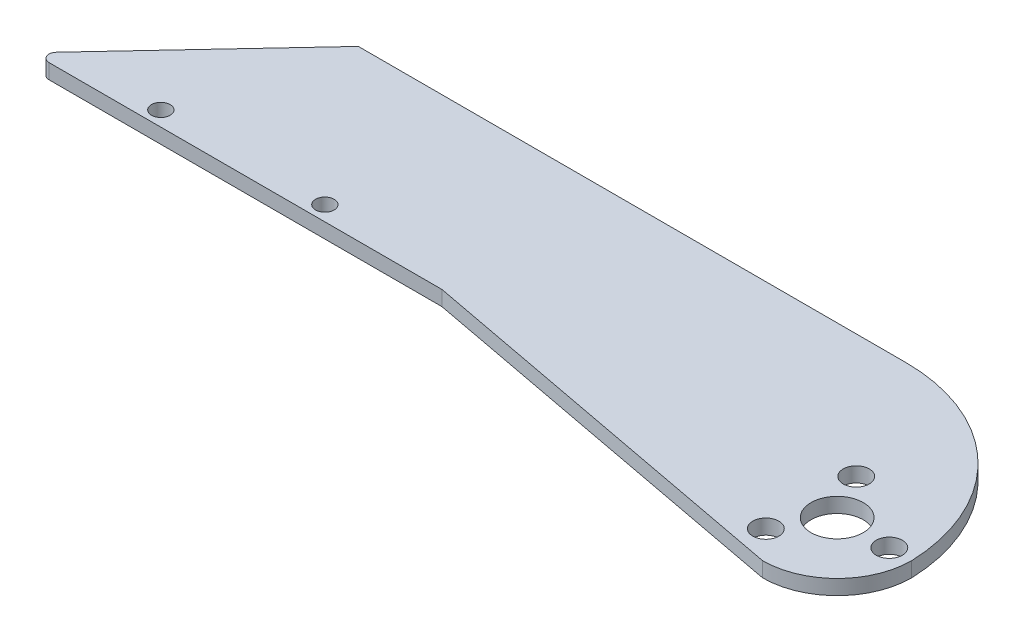
ISO-10303-21;
HEADER;
FILE_DESCRIPTION(('STEP AP214'),'2;1');
FILE_NAME('part.step','',(''),(''),'','','');
FILE_SCHEMA(('AUTOMOTIVE_DESIGN { 1 0 10303 214 1 1 1 1 }'));
ENDSEC;
DATA;
#1=APPLICATION_CONTEXT('core data for automotive mechanical design processes');
#2=APPLICATION_PROTOCOL_DEFINITION('international standard','automotive_design',2000,#1);
#3=PRODUCT_CONTEXT('',#1,'mechanical');
#4=PRODUCT('Part','Part','',(#3));
#5=PRODUCT_RELATED_PRODUCT_CATEGORY('part','',(#4));
#6=PRODUCT_DEFINITION_FORMATION('','',#4);
#7=PRODUCT_DEFINITION_CONTEXT('part definition',#1,'design');
#8=PRODUCT_DEFINITION('design','',#6,#7);
#9=PRODUCT_DEFINITION_SHAPE('','',#8);
#10=(LENGTH_UNIT() NAMED_UNIT(*) SI_UNIT(.MILLI.,.METRE.));
#11=(NAMED_UNIT(*) PLANE_ANGLE_UNIT() SI_UNIT($,.RADIAN.));
#12=(NAMED_UNIT(*) SI_UNIT($,.STERADIAN.) SOLID_ANGLE_UNIT());
#13=UNCERTAINTY_MEASURE_WITH_UNIT(LENGTH_MEASURE(1.E-05),#10,'distance_accuracy_value','');
#14=(GEOMETRIC_REPRESENTATION_CONTEXT(3) GLOBAL_UNCERTAINTY_ASSIGNED_CONTEXT((#13)) GLOBAL_UNIT_ASSIGNED_CONTEXT((#10,
#11,#12)) REPRESENTATION_CONTEXT('',''));
#15=CARTESIAN_POINT('',(0.,0.,0.));
#16=DIRECTION('',(0.,0.,1.));
#17=DIRECTION('',(1.,0.,0.));
#18=AXIS2_PLACEMENT_3D('',#15,#16,#17);
#19=CARTESIAN_POINT('',(-13.4267183875394,2.,0.818104259805705));
#20=DIRECTION('',(0.,-1.,0.));
#21=DIRECTION('',(0.,0.,-1.));
#22=AXIS2_PLACEMENT_3D('',#19,#20,#21);
#23=CYLINDRICAL_SURFACE('',#22,23.4409988905975);
#24=CARTESIAN_POINT('',(-13.4267183875394,0.,0.818104259805705));
#25=DIRECTION('',(0.,1.,0.));
#26=DIRECTION('',(0.,0.,1.));
#27=AXIS2_PLACEMENT_3D('',#24,#25,#26);
#28=CIRCLE('',#27,23.4409988905975);
#29=CARTESIAN_POINT('',(-13.4267183875394,0.,-22.6228946307918));
#30=VERTEX_POINT('',#29);
#31=CARTESIAN_POINT('',(10.,0.,-3.42607886505419E-13));
#32=VERTEX_POINT('',#31);
#33=EDGE_CURVE('E98',#30,#32,#28,.F.);
#34=ORIENTED_EDGE('',*,*,#33,.F.);
#35=DIRECTION('',(0.,-1.,0.));
#36=VECTOR('',#35,1.);
#37=CARTESIAN_POINT('',(-13.4267183875394,2.,-22.6228946307918));
#38=LINE('',#37,#36);
#39=CARTESIAN_POINT('',(-13.4267183875394,2.,-22.6228946307918));
#40=VERTEX_POINT('',#39);
#41=EDGE_CURVE('E94',#40,#30,#38,.T.);
#42=ORIENTED_EDGE('',*,*,#41,.F.);
#43=CARTESIAN_POINT('',(-13.4267183875394,2.,0.818104259805705));
#44=DIRECTION('',(0.,1.,0.));
#45=DIRECTION('',(0.,0.,1.));
#46=AXIS2_PLACEMENT_3D('',#43,#44,#45);
#47=CIRCLE('',#46,23.4409988905975);
#48=CARTESIAN_POINT('',(10.,2.,-3.42607886505419E-13));
#49=VERTEX_POINT('',#48);
#50=EDGE_CURVE('E96',#40,#49,#47,.F.);
#51=ORIENTED_EDGE('',*,*,#50,.T.);
#52=DIRECTION('',(0.,-1.,0.));
#53=VECTOR('',#52,1.);
#54=CARTESIAN_POINT('',(10.,2.,-3.42607886505419E-13));
#55=LINE('',#54,#53);
#56=EDGE_CURVE('E146',#49,#32,#55,.T.);
#57=ORIENTED_EDGE('',*,*,#56,.T.);
#58=EDGE_LOOP('',(#34,#42,#51,#57));
#59=FACE_BOUND('',#58,.T.);
#60=ADVANCED_FACE('F37',(#59),#23,.T.);
#61=CARTESIAN_POINT('',(0.,2.,-22.6228946307918));
#62=DIRECTION('',(0.,0.,-1.));
#63=DIRECTION('',(-1.,0.,0.));
#64=AXIS2_PLACEMENT_3D('',#61,#62,#63);
#65=PLANE('',#64);
#66=DIRECTION('',(1.,0.,0.));
#67=VECTOR('',#66,1.);
#68=CARTESIAN_POINT('',(0.,0.,-22.6228946307918));
#69=LINE('',#68,#67);
#70=CARTESIAN_POINT('',(-86.8373877704956,0.,-22.6228946307918));
#71=VERTEX_POINT('',#70);
#72=EDGE_CURVE('E151',#71,#30,#69,.T.);
#73=ORIENTED_EDGE('',*,*,#72,.F.);
#74=DIRECTION('',(0.,-1.,0.));
#75=VECTOR('',#74,1.);
#76=CARTESIAN_POINT('',(-86.8373877704956,2.,-22.6228946307918));
#77=LINE('',#76,#75);
#78=CARTESIAN_POINT('',(-86.8373877704956,2.,-22.6228946307918));
#79=VERTEX_POINT('',#78);
#80=EDGE_CURVE('E104',#79,#71,#77,.T.);
#81=ORIENTED_EDGE('',*,*,#80,.F.);
#82=DIRECTION('',(1.,0.,0.));
#83=VECTOR('',#82,1.);
#84=CARTESIAN_POINT('',(0.,2.,-22.6228946307918));
#85=LINE('',#84,#83);
#86=EDGE_CURVE('E110',#79,#40,#85,.T.);
#87=ORIENTED_EDGE('',*,*,#86,.T.);
#88=ORIENTED_EDGE('',*,*,#41,.T.);
#89=EDGE_LOOP('',(#73,#81,#87,#88));
#90=FACE_BOUND('',#89,.T.);
#91=ADVANCED_FACE('F118',(#90),#65,.T.);
#92=CARTESIAN_POINT('',(-57.5978863276352,2.,-53.8800075535761));
#93=DIRECTION('',(-0.730283343841908,0.,-0.683144375448617));
#94=DIRECTION('',(-0.683144375448617,0.,0.730283343841908));
#95=AXIS2_PLACEMENT_3D('',#92,#93,#94);
#96=PLANE('',#95);
#97=DIRECTION('',(0.683144375448617,0.,-0.730283343841908));
#98=VECTOR('',#97,1.);
#99=CARTESIAN_POINT('',(-57.5978863276352,0.,-53.8800075535761));
#100=LINE('',#99,#98);
#101=CARTESIAN_POINT('',(-106.425500700719,0.,-1.6831443754486));
#102=VERTEX_POINT('',#101);
#103=EDGE_CURVE('E153',#102,#71,#100,.T.);
#104=ORIENTED_EDGE('',*,*,#103,.F.);
#105=DIRECTION('',(0.,-1.,0.));
#106=VECTOR('',#105,1.);
#107=CARTESIAN_POINT('',(-106.425500700719,2.,-1.68314437544861));
#108=LINE('',#107,#106);
#109=CARTESIAN_POINT('',(-106.425500700719,2.,-1.6831443754486));
#110=VERTEX_POINT('',#109);
#111=EDGE_CURVE('E45',#102,#110,#108,.F.);
#112=ORIENTED_EDGE('',*,*,#111,.T.);
#113=DIRECTION('',(0.683144375448617,0.,-0.730283343841908));
#114=VECTOR('',#113,1.);
#115=CARTESIAN_POINT('',(-57.5978863276352,2.,-53.8800075535761));
#116=LINE('',#115,#114);
#117=EDGE_CURVE('E120',#110,#79,#116,.T.);
#118=ORIENTED_EDGE('',*,*,#117,.T.);
#119=ORIENTED_EDGE('',*,*,#80,.T.);
#120=EDGE_LOOP('',(#104,#112,#118,#119));
#121=FACE_BOUND('',#120,.T.);
#122=ADVANCED_FACE('F211',(#121),#96,.T.);
#123=CARTESIAN_POINT('',(0.,2.,0.));
#124=DIRECTION('',(0.,0.,-1.));
#125=DIRECTION('',(-1.,0.,0.));
#126=AXIS2_PLACEMENT_3D('',#123,#124,#125);
#127=PLANE('',#126);
#128=DIRECTION('',(1.,0.,0.));
#129=VECTOR('',#128,1.);
#130=CARTESIAN_POINT('',(0.,2.,0.));
#131=LINE('',#130,#129);
#132=CARTESIAN_POINT('',(-105.695217356877,2.,0.));
#133=VERTEX_POINT('',#132);
#134=CARTESIAN_POINT('',(-53.,2.,0.));
#135=VERTEX_POINT('',#134);
#136=EDGE_CURVE('E122',#133,#135,#131,.T.);
#137=ORIENTED_EDGE('',*,*,#136,.F.);
#138=DIRECTION('',(0.,-1.,0.));
#139=VECTOR('',#138,1.);
#140=CARTESIAN_POINT('',(-105.695217356877,0.,0.));
#141=LINE('',#140,#139);
#142=CARTESIAN_POINT('',(-105.695217356877,0.,0.));
#143=VERTEX_POINT('',#142);
#144=EDGE_CURVE('E103',#133,#143,#141,.T.);
#145=ORIENTED_EDGE('',*,*,#144,.T.);
#146=DIRECTION('',(1.,0.,0.));
#147=VECTOR('',#146,1.);
#148=CARTESIAN_POINT('',(0.,0.,0.));
#149=LINE('',#148,#147);
#150=CARTESIAN_POINT('',(-53.,0.,0.));
#151=VERTEX_POINT('',#150);
#152=EDGE_CURVE('E155',#143,#151,#149,.T.);
#153=ORIENTED_EDGE('',*,*,#152,.T.);
#154=DIRECTION('',(0.,-1.,0.));
#155=VECTOR('',#154,1.);
#156=CARTESIAN_POINT('',(-53.,2.,0.));
#157=LINE('',#156,#155);
#158=EDGE_CURVE('E181',#135,#151,#157,.T.);
#159=ORIENTED_EDGE('',*,*,#158,.F.);
#160=EDGE_LOOP('',(#137,#145,#153,#159));
#161=FACE_BOUND('',#160,.T.);
#162=ADVANCED_FACE('F190',(#161),#127,.F.);
#163=CARTESIAN_POINT('',(-1.82193193537298,2.,9.6562392574768));
#164=DIRECTION('',(-0.185407859197825,0.,0.982661653748471));
#165=DIRECTION('',(0.982661653748471,0.,0.185407859197825));
#166=AXIS2_PLACEMENT_3D('',#163,#164,#165);
#167=PLANE('',#166);
#168=DIRECTION('',(-0.982661653748471,0.,-0.185407859197825));
#169=VECTOR('',#168,1.);
#170=CARTESIAN_POINT('',(-1.82193193537298,0.,9.6562392574768));
#171=LINE('',#170,#169);
#172=CARTESIAN_POINT('',(0.,0.,10.));
#173=VERTEX_POINT('',#172);
#174=EDGE_CURVE('E157',#173,#151,#171,.T.);
#175=ORIENTED_EDGE('',*,*,#174,.F.);
#176=DIRECTION('',(0.,-1.,0.));
#177=VECTOR('',#176,1.);
#178=CARTESIAN_POINT('',(0.,2.,10.));
#179=LINE('',#178,#177);
#180=CARTESIAN_POINT('',(0.,2.,10.));
#181=VERTEX_POINT('',#180);
#182=EDGE_CURVE('E179',#181,#173,#179,.T.);
#183=ORIENTED_EDGE('',*,*,#182,.F.);
#184=DIRECTION('',(-0.982661653748471,0.,-0.185407859197825));
#185=VECTOR('',#184,1.);
#186=CARTESIAN_POINT('',(-1.82193193537298,2.,9.6562392574768));
#187=LINE('',#186,#185);
#188=EDGE_CURVE('E127',#181,#135,#187,.T.);
#189=ORIENTED_EDGE('',*,*,#188,.T.);
#190=ORIENTED_EDGE('',*,*,#158,.T.);
#191=EDGE_LOOP('',(#175,#183,#189,#190));
#192=FACE_BOUND('',#191,.T.);
#193=ADVANCED_FACE('F199',(#192),#167,.T.);
#194=CARTESIAN_POINT('',(7.,2.,0.));
#195=DIRECTION('',(0.,-1.,0.));
#196=DIRECTION('',(0.,0.,-1.));
#197=AXIS2_PLACEMENT_3D('',#194,#195,#196);
#198=CYLINDRICAL_SURFACE('',#197,1.75);
#199=CARTESIAN_POINT('',(7.,2.,0.));
#200=DIRECTION('',(0.,1.,0.));
#201=DIRECTION('',(0.,0.,1.));
#202=AXIS2_PLACEMENT_3D('',#199,#200,#201);
#203=CIRCLE('',#202,1.75);
#204=CARTESIAN_POINT('',(7.,2.,1.75));
#205=VERTEX_POINT('',#204);
#206=EDGE_CURVE('E140',#205,#205,#203,.T.);
#207=ORIENTED_EDGE('',*,*,#206,.T.);
#208=EDGE_LOOP('',(#207));
#209=FACE_BOUND('',#208,.T.);
#210=CARTESIAN_POINT('',(7.,0.,0.));
#211=DIRECTION('',(0.,1.,0.));
#212=DIRECTION('',(0.,0.,1.));
#213=AXIS2_PLACEMENT_3D('',#210,#211,#212);
#214=CIRCLE('',#213,1.75);
#215=CARTESIAN_POINT('',(7.,0.,1.75));
#216=VERTEX_POINT('',#215);
#217=EDGE_CURVE('E172',#216,#216,#214,.T.);
#218=ORIENTED_EDGE('',*,*,#217,.F.);
#219=EDGE_LOOP('',(#218));
#220=FACE_BOUND('',#219,.T.);
#221=ADVANCED_FACE('F238',(#209,#220),#198,.F.);
#222=CARTESIAN_POINT('',(-92.7051831779957,2.,-2.));
#223=DIRECTION('',(0.,-1.,0.));
#224=DIRECTION('',(0.,0.,-1.));
#225=AXIS2_PLACEMENT_3D('',#222,#223,#224);
#226=CYLINDRICAL_SURFACE('',#225,1.25);
#227=CARTESIAN_POINT('',(-92.7051831779957,2.,-2.));
#228=DIRECTION('',(0.,1.,0.));
#229=DIRECTION('',(0.,0.,1.));
#230=AXIS2_PLACEMENT_3D('',#227,#228,#229);
#231=CIRCLE('',#230,1.25);
#232=CARTESIAN_POINT('',(-92.7051831779957,2.,-0.750000000000002));
#233=VERTEX_POINT('',#232);
#234=EDGE_CURVE('E137',#233,#233,#231,.T.);
#235=ORIENTED_EDGE('',*,*,#234,.T.);
#236=EDGE_LOOP('',(#235));
#237=FACE_BOUND('',#236,.T.);
#238=CARTESIAN_POINT('',(-92.7051831779957,0.,-2.));
#239=DIRECTION('',(0.,1.,0.));
#240=DIRECTION('',(0.,0.,1.));
#241=AXIS2_PLACEMENT_3D('',#238,#239,#240);
#242=CIRCLE('',#241,1.25);
#243=CARTESIAN_POINT('',(-92.7051831779957,0.,-0.750000000000002));
#244=VERTEX_POINT('',#243);
#245=EDGE_CURVE('E169',#244,#244,#242,.T.);
#246=ORIENTED_EDGE('',*,*,#245,.F.);
#247=EDGE_LOOP('',(#246));
#248=FACE_BOUND('',#247,.T.);
#249=ADVANCED_FACE('F241',(#237,#248),#226,.F.);
#250=CARTESIAN_POINT('',(-70.7051831779957,2.,-2.));
#251=DIRECTION('',(0.,-1.,0.));
#252=DIRECTION('',(0.,0.,-1.));
#253=AXIS2_PLACEMENT_3D('',#250,#251,#252);
#254=CYLINDRICAL_SURFACE('',#253,1.25);
#255=CARTESIAN_POINT('',(-70.7051831779957,2.,-2.));
#256=DIRECTION('',(0.,1.,0.));
#257=DIRECTION('',(0.,0.,1.));
#258=AXIS2_PLACEMENT_3D('',#255,#256,#257);
#259=CIRCLE('',#258,1.25);
#260=CARTESIAN_POINT('',(-70.7051831779957,2.,-0.750000000000002));
#261=VERTEX_POINT('',#260);
#262=EDGE_CURVE('E134',#261,#261,#259,.T.);
#263=ORIENTED_EDGE('',*,*,#262,.T.);
#264=EDGE_LOOP('',(#263));
#265=FACE_BOUND('',#264,.T.);
#266=CARTESIAN_POINT('',(-70.7051831779957,0.,-2.));
#267=DIRECTION('',(0.,1.,0.));
#268=DIRECTION('',(0.,0.,1.));
#269=AXIS2_PLACEMENT_3D('',#266,#267,#268);
#270=CIRCLE('',#269,1.25);
#271=CARTESIAN_POINT('',(-70.7051831779957,0.,-0.750000000000002));
#272=VERTEX_POINT('',#271);
#273=EDGE_CURVE('E166',#272,#272,#270,.T.);
#274=ORIENTED_EDGE('',*,*,#273,.F.);
#275=EDGE_LOOP('',(#274));
#276=FACE_BOUND('',#275,.T.);
#277=ADVANCED_FACE('F245',(#265,#276),#254,.F.);
#278=CARTESIAN_POINT('',(-3.5,2.,-6.06217782649107));
#279=DIRECTION('',(0.,-1.,0.));
#280=DIRECTION('',(0.,0.,-1.));
#281=AXIS2_PLACEMENT_3D('',#278,#279,#280);
#282=CYLINDRICAL_SURFACE('',#281,1.75);
#283=CARTESIAN_POINT('',(-3.5,2.,-6.06217782649107));
#284=DIRECTION('',(0.,1.,0.));
#285=DIRECTION('',(0.,0.,1.));
#286=AXIS2_PLACEMENT_3D('',#283,#284,#285);
#287=CIRCLE('',#286,1.75);
#288=CARTESIAN_POINT('',(-3.5,2.,-4.31217782649107));
#289=VERTEX_POINT('',#288);
#290=EDGE_CURVE('E131',#289,#289,#287,.T.);
#291=ORIENTED_EDGE('',*,*,#290,.T.);
#292=EDGE_LOOP('',(#291));
#293=FACE_BOUND('',#292,.T.);
#294=CARTESIAN_POINT('',(-3.5,0.,-6.06217782649107));
#295=DIRECTION('',(0.,1.,0.));
#296=DIRECTION('',(0.,0.,1.));
#297=AXIS2_PLACEMENT_3D('',#294,#295,#296);
#298=CIRCLE('',#297,1.75);
#299=CARTESIAN_POINT('',(-3.5,0.,-4.31217782649107));
#300=VERTEX_POINT('',#299);
#301=EDGE_CURVE('E163',#300,#300,#298,.T.);
#302=ORIENTED_EDGE('',*,*,#301,.F.);
#303=EDGE_LOOP('',(#302));
#304=FACE_BOUND('',#303,.T.);
#305=ADVANCED_FACE('F225',(#293,#304),#282,.F.);
#306=CARTESIAN_POINT('',(0.,2.,0.));
#307=DIRECTION('',(0.,-1.,0.));
#308=DIRECTION('',(0.,0.,-1.));
#309=AXIS2_PLACEMENT_3D('',#306,#307,#308);
#310=CYLINDRICAL_SURFACE('',#309,10.);
#311=CARTESIAN_POINT('',(0.,0.,0.));
#312=DIRECTION('',(0.,1.,0.));
#313=DIRECTION('',(0.,0.,1.));
#314=AXIS2_PLACEMENT_3D('',#311,#312,#313);
#315=CIRCLE('',#314,10.);
#316=EDGE_CURVE('E160',#173,#32,#315,.T.);
#317=ORIENTED_EDGE('',*,*,#316,.T.);
#318=ORIENTED_EDGE('',*,*,#56,.F.);
#319=CARTESIAN_POINT('',(0.,2.,0.));
#320=DIRECTION('',(0.,1.,0.));
#321=DIRECTION('',(0.,0.,1.));
#322=AXIS2_PLACEMENT_3D('',#319,#320,#321);
#323=CIRCLE('',#322,10.);
#324=EDGE_CURVE('E113',#181,#49,#323,.T.);
#325=ORIENTED_EDGE('',*,*,#324,.F.);
#326=ORIENTED_EDGE('',*,*,#182,.T.);
#327=EDGE_LOOP('',(#317,#318,#325,#326));
#328=FACE_BOUND('',#327,.T.);
#329=ADVANCED_FACE('F217',(#328),#310,.T.);
#330=CARTESIAN_POINT('',(0.,2.,0.));
#331=DIRECTION('',(0.,-1.,0.));
#332=DIRECTION('',(0.,0.,-1.));
#333=AXIS2_PLACEMENT_3D('',#330,#331,#332);
#334=CYLINDRICAL_SURFACE('',#333,3.5);
#335=CARTESIAN_POINT('',(0.,2.,0.));
#336=DIRECTION('',(0.,1.,0.));
#337=DIRECTION('',(0.,0.,1.));
#338=AXIS2_PLACEMENT_3D('',#335,#336,#337);
#339=CIRCLE('',#338,3.5);
#340=CARTESIAN_POINT('',(0.,2.,3.5));
#341=VERTEX_POINT('',#340);
#342=EDGE_CURVE('E115',#341,#341,#339,.T.);
#343=ORIENTED_EDGE('',*,*,#342,.T.);
#344=EDGE_LOOP('',(#343));
#345=FACE_BOUND('',#344,.T.);
#346=CARTESIAN_POINT('',(0.,0.,0.));
#347=DIRECTION('',(0.,1.,0.));
#348=DIRECTION('',(0.,0.,1.));
#349=AXIS2_PLACEMENT_3D('',#346,#347,#348);
#350=CIRCLE('',#349,3.5);
#351=CARTESIAN_POINT('',(0.,0.,3.5));
#352=VERTEX_POINT('',#351);
#353=EDGE_CURVE('E147',#352,#352,#350,.T.);
#354=ORIENTED_EDGE('',*,*,#353,.F.);
#355=EDGE_LOOP('',(#354));
#356=FACE_BOUND('',#355,.T.);
#357=ADVANCED_FACE('F214',(#345,#356),#334,.F.);
#358=CARTESIAN_POINT('',(-3.5,2.,6.06217782649107));
#359=DIRECTION('',(0.,-1.,0.));
#360=DIRECTION('',(0.,0.,-1.));
#361=AXIS2_PLACEMENT_3D('',#358,#359,#360);
#362=CYLINDRICAL_SURFACE('',#361,1.75);
#363=CARTESIAN_POINT('',(-3.5,2.,6.06217782649107));
#364=DIRECTION('',(0.,1.,0.));
#365=DIRECTION('',(0.,0.,1.));
#366=AXIS2_PLACEMENT_3D('',#363,#364,#365);
#367=CIRCLE('',#366,1.75);
#368=CARTESIAN_POINT('',(-3.5,2.,7.81217782649107));
#369=VERTEX_POINT('',#368);
#370=EDGE_CURVE('E143',#369,#369,#367,.T.);
#371=ORIENTED_EDGE('',*,*,#370,.T.);
#372=EDGE_LOOP('',(#371));
#373=FACE_BOUND('',#372,.T.);
#374=CARTESIAN_POINT('',(-3.5,0.,6.06217782649107));
#375=DIRECTION('',(0.,1.,0.));
#376=DIRECTION('',(0.,0.,1.));
#377=AXIS2_PLACEMENT_3D('',#374,#375,#376);
#378=CIRCLE('',#377,1.75);
#379=CARTESIAN_POINT('',(-3.5,0.,7.81217782649107));
#380=VERTEX_POINT('',#379);
#381=EDGE_CURVE('E175',#380,#380,#378,.T.);
#382=ORIENTED_EDGE('',*,*,#381,.F.);
#383=EDGE_LOOP('',(#382));
#384=FACE_BOUND('',#383,.T.);
#385=ADVANCED_FACE('F216',(#373,#384),#362,.F.);
#386=CARTESIAN_POINT('',(0.,2.,0.));
#387=DIRECTION('',(0.,1.,0.));
#388=DIRECTION('',(0.,0.,1.));
#389=AXIS2_PLACEMENT_3D('',#386,#387,#388);
#390=PLANE('',#389);
#391=ORIENTED_EDGE('',*,*,#342,.F.);
#392=EDGE_LOOP('',(#391));
#393=FACE_BOUND('',#392,.T.);
#394=ORIENTED_EDGE('',*,*,#117,.F.);
#395=CARTESIAN_POINT('',(-105.695217356877,2.,-0.99999999999998));
#396=DIRECTION('',(0.,1.,0.));
#397=DIRECTION('',(0.,0.,1.));
#398=AXIS2_PLACEMENT_3D('',#395,#396,#397);
#399=CIRCLE('',#398,1.);
#400=EDGE_CURVE('E11',#110,#133,#399,.T.);
#401=ORIENTED_EDGE('',*,*,#400,.T.);
#402=ORIENTED_EDGE('',*,*,#136,.T.);
#403=ORIENTED_EDGE('',*,*,#188,.F.);
#404=ORIENTED_EDGE('',*,*,#324,.T.);
#405=ORIENTED_EDGE('',*,*,#50,.F.);
#406=ORIENTED_EDGE('',*,*,#86,.F.);
#407=EDGE_LOOP('',(#394,#401,#402,#403,#404,#405,#406));
#408=FACE_BOUND('',#407,.T.);
#409=ORIENTED_EDGE('',*,*,#290,.F.);
#410=EDGE_LOOP('',(#409));
#411=FACE_BOUND('',#410,.T.);
#412=ORIENTED_EDGE('',*,*,#262,.F.);
#413=EDGE_LOOP('',(#412));
#414=FACE_BOUND('',#413,.T.);
#415=ORIENTED_EDGE('',*,*,#234,.F.);
#416=EDGE_LOOP('',(#415));
#417=FACE_BOUND('',#416,.T.);
#418=ORIENTED_EDGE('',*,*,#206,.F.);
#419=EDGE_LOOP('',(#418));
#420=FACE_BOUND('',#419,.T.);
#421=ORIENTED_EDGE('',*,*,#370,.F.);
#422=EDGE_LOOP('',(#421));
#423=FACE_BOUND('',#422,.T.);
#424=ADVANCED_FACE('F108',(#393,#408,#411,#414,#417,#420,#423),#390,.T.);
#425=CARTESIAN_POINT('',(0.,0.,0.));
#426=DIRECTION('',(0.,1.,0.));
#427=DIRECTION('',(0.,0.,1.));
#428=AXIS2_PLACEMENT_3D('',#425,#426,#427);
#429=PLANE('',#428);
#430=ORIENTED_EDGE('',*,*,#353,.T.);
#431=EDGE_LOOP('',(#430));
#432=FACE_BOUND('',#431,.T.);
#433=ORIENTED_EDGE('',*,*,#152,.F.);
#434=CARTESIAN_POINT('',(-105.695217356877,0.,-0.99999999999998));
#435=DIRECTION('',(0.,1.,0.));
#436=DIRECTION('',(0.,0.,1.));
#437=AXIS2_PLACEMENT_3D('',#434,#435,#436);
#438=CIRCLE('',#437,1.);
#439=EDGE_CURVE('E59',#143,#102,#438,.F.);
#440=ORIENTED_EDGE('',*,*,#439,.T.);
#441=ORIENTED_EDGE('',*,*,#103,.T.);
#442=ORIENTED_EDGE('',*,*,#72,.T.);
#443=ORIENTED_EDGE('',*,*,#33,.T.);
#444=ORIENTED_EDGE('',*,*,#316,.F.);
#445=ORIENTED_EDGE('',*,*,#174,.T.);
#446=EDGE_LOOP('',(#433,#440,#441,#442,#443,#444,#445));
#447=FACE_BOUND('',#446,.T.);
#448=ORIENTED_EDGE('',*,*,#301,.T.);
#449=EDGE_LOOP('',(#448));
#450=FACE_BOUND('',#449,.T.);
#451=ORIENTED_EDGE('',*,*,#273,.T.);
#452=EDGE_LOOP('',(#451));
#453=FACE_BOUND('',#452,.T.);
#454=ORIENTED_EDGE('',*,*,#245,.T.);
#455=EDGE_LOOP('',(#454));
#456=FACE_BOUND('',#455,.T.);
#457=ORIENTED_EDGE('',*,*,#217,.T.);
#458=EDGE_LOOP('',(#457));
#459=FACE_BOUND('',#458,.T.);
#460=ORIENTED_EDGE('',*,*,#381,.T.);
#461=EDGE_LOOP('',(#460));
#462=FACE_BOUND('',#461,.T.);
#463=ADVANCED_FACE('F194',(#432,#447,#450,#453,#456,#459,#462),#429,.F.);
#464=CARTESIAN_POINT('',(-105.695217356877,2.,-0.99999999999998));
#465=DIRECTION('',(0.,1.,0.));
#466=DIRECTION('',(0.,0.,1.));
#467=AXIS2_PLACEMENT_3D('',#464,#465,#466);
#468=CYLINDRICAL_SURFACE('',#467,1.);
#469=ORIENTED_EDGE('',*,*,#400,.F.);
#470=ORIENTED_EDGE('',*,*,#111,.F.);
#471=ORIENTED_EDGE('',*,*,#439,.F.);
#472=ORIENTED_EDGE('',*,*,#144,.F.);
#473=EDGE_LOOP('',(#469,#470,#471,#472));
#474=FACE_BOUND('',#473,.T.);
#475=ADVANCED_FACE('F39',(#474),#468,.T.);
#476=CLOSED_SHELL('',(#60,#91,#122,#162,#193,#221,#249,#277,#305,#329,#357,#385,#424,#463,#475));
#477=MANIFOLD_SOLID_BREP('B2',#476);
#478=ADVANCED_BREP_SHAPE_REPRESENTATION('',(#18,#477),#14);
#479=SHAPE_DEFINITION_REPRESENTATION(#9,#478);
ENDSEC;
END-ISO-10303-21;
